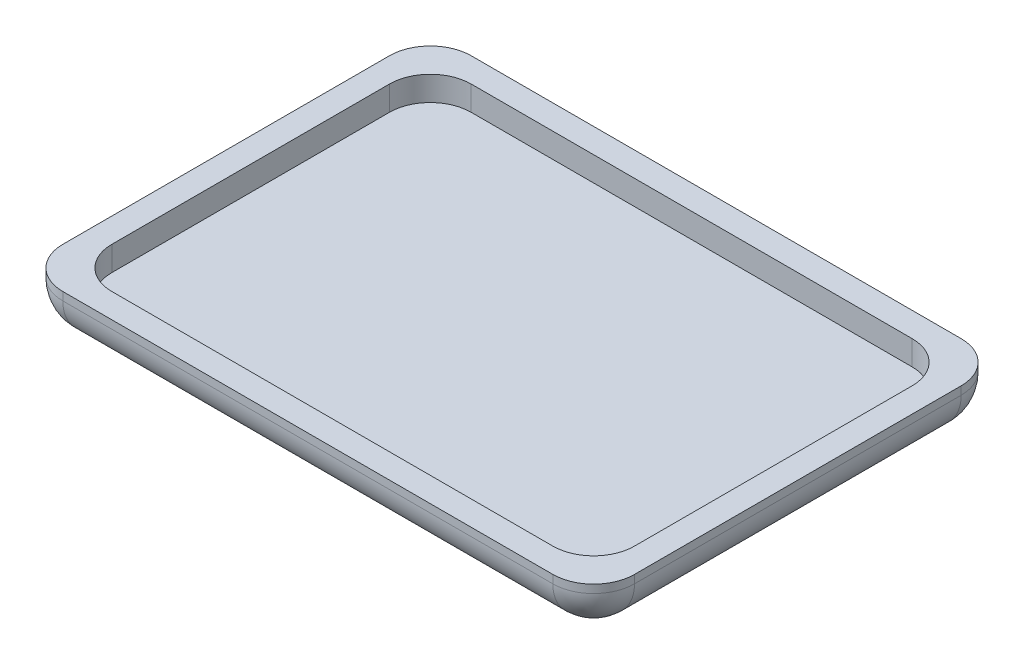
ISO-10303-21;
HEADER;
FILE_DESCRIPTION(('STEP AP214'),'2;1');
FILE_NAME('part.step','',(''),(''),'','','');
FILE_SCHEMA(('AUTOMOTIVE_DESIGN { 1 0 10303 214 1 1 1 1 }'));
ENDSEC;
DATA;
#1=APPLICATION_CONTEXT('core data for automotive mechanical design processes');
#2=APPLICATION_PROTOCOL_DEFINITION('international standard','automotive_design',2000,#1);
#3=PRODUCT_CONTEXT('',#1,'mechanical');
#4=PRODUCT('Part','Part','',(#3));
#5=PRODUCT_RELATED_PRODUCT_CATEGORY('part','',(#4));
#6=PRODUCT_DEFINITION_FORMATION('','',#4);
#7=PRODUCT_DEFINITION_CONTEXT('part definition',#1,'design');
#8=PRODUCT_DEFINITION('design','',#6,#7);
#9=PRODUCT_DEFINITION_SHAPE('','',#8);
#10=(LENGTH_UNIT() NAMED_UNIT(*) SI_UNIT(.MILLI.,.METRE.));
#11=(NAMED_UNIT(*) PLANE_ANGLE_UNIT() SI_UNIT($,.RADIAN.));
#12=(NAMED_UNIT(*) SI_UNIT($,.STERADIAN.) SOLID_ANGLE_UNIT());
#13=UNCERTAINTY_MEASURE_WITH_UNIT(LENGTH_MEASURE(1.E-05),#10,'distance_accuracy_value','');
#14=(GEOMETRIC_REPRESENTATION_CONTEXT(3) GLOBAL_UNCERTAINTY_ASSIGNED_CONTEXT((#13)) GLOBAL_UNIT_ASSIGNED_CONTEXT((#10,
#11,#12)) REPRESENTATION_CONTEXT('',''));
#15=CARTESIAN_POINT('',(0.,0.,0.));
#16=DIRECTION('',(0.,0.,1.));
#17=DIRECTION('',(1.,0.,0.));
#18=AXIS2_PLACEMENT_3D('',#15,#16,#17);
#19=CARTESIAN_POINT('',(27.,5.99999999999999,-17.));
#20=DIRECTION('',(0.,-1.,0.));
#21=DIRECTION('',(0.,0.,-1.));
#22=AXIS2_PLACEMENT_3D('',#19,#20,#21);
#23=CYLINDRICAL_SURFACE('',#22,5.);
#24=DIRECTION('',(0.,1.,0.));
#25=VECTOR('',#24,1.);
#26=CARTESIAN_POINT('',(27.,5.99999999999999,-22.));
#27=LINE('',#26,#25);
#28=CARTESIAN_POINT('',(27.,3.,-22.));
#29=VERTEX_POINT('',#28);
#30=CARTESIAN_POINT('',(27.,5.99999999999999,-22.));
#31=VERTEX_POINT('',#30);
#32=EDGE_CURVE('E285',#29,#31,#27,.T.);
#33=ORIENTED_EDGE('',*,*,#32,.F.);
#34=CARTESIAN_POINT('',(27.,3.,-17.));
#35=DIRECTION('',(0.,1.,0.));
#36=DIRECTION('',(0.,0.,1.));
#37=AXIS2_PLACEMENT_3D('',#34,#35,#36);
#38=CIRCLE('',#37,5.);
#39=CARTESIAN_POINT('',(32.,3.,-17.));
#40=VERTEX_POINT('',#39);
#41=EDGE_CURVE('E40',#40,#29,#38,.T.);
#42=ORIENTED_EDGE('',*,*,#41,.F.);
#43=DIRECTION('',(0.,1.,0.));
#44=VECTOR('',#43,1.);
#45=CARTESIAN_POINT('',(32.,5.99999999999999,-17.));
#46=LINE('',#45,#44);
#47=CARTESIAN_POINT('',(32.,5.99999999999999,-17.));
#48=VERTEX_POINT('',#47);
#49=EDGE_CURVE('E288',#48,#40,#46,.F.);
#50=ORIENTED_EDGE('',*,*,#49,.F.);
#51=CARTESIAN_POINT('',(27.,5.99999999999999,-17.));
#52=DIRECTION('',(0.,1.,0.));
#53=DIRECTION('',(0.,0.,1.));
#54=AXIS2_PLACEMENT_3D('',#51,#52,#53);
#55=CIRCLE('',#54,5.);
#56=EDGE_CURVE('E11',#48,#31,#55,.T.);
#57=ORIENTED_EDGE('',*,*,#56,.T.);
#58=EDGE_LOOP('',(#33,#42,#50,#57));
#59=FACE_BOUND('',#58,.T.);
#60=ADVANCED_FACE('F33',(#59),#23,.F.);
#61=CARTESIAN_POINT('',(-27.,5.99999999999999,-17.));
#62=DIRECTION('',(0.,-1.,0.));
#63=DIRECTION('',(0.,0.,-1.));
#64=AXIS2_PLACEMENT_3D('',#61,#62,#63);
#65=CYLINDRICAL_SURFACE('',#64,5.);
#66=DIRECTION('',(0.,1.,0.));
#67=VECTOR('',#66,1.);
#68=CARTESIAN_POINT('',(-32.,5.99999999999999,-17.));
#69=LINE('',#68,#67);
#70=CARTESIAN_POINT('',(-32.,3.,-17.));
#71=VERTEX_POINT('',#70);
#72=CARTESIAN_POINT('',(-32.,5.99999999999999,-17.));
#73=VERTEX_POINT('',#72);
#74=EDGE_CURVE('E275',#71,#73,#69,.T.);
#75=ORIENTED_EDGE('',*,*,#74,.F.);
#76=CARTESIAN_POINT('',(-27.,3.,-17.));
#77=DIRECTION('',(0.,1.,0.));
#78=DIRECTION('',(0.,0.,1.));
#79=AXIS2_PLACEMENT_3D('',#76,#77,#78);
#80=CIRCLE('',#79,5.);
#81=CARTESIAN_POINT('',(-27.,3.,-22.));
#82=VERTEX_POINT('',#81);
#83=EDGE_CURVE('E281',#82,#71,#80,.T.);
#84=ORIENTED_EDGE('',*,*,#83,.F.);
#85=DIRECTION('',(0.,1.,0.));
#86=VECTOR('',#85,1.);
#87=CARTESIAN_POINT('',(-27.,5.99999999999999,-22.));
#88=LINE('',#87,#86);
#89=CARTESIAN_POINT('',(-27.,5.99999999999999,-22.));
#90=VERTEX_POINT('',#89);
#91=EDGE_CURVE('E278',#90,#82,#88,.F.);
#92=ORIENTED_EDGE('',*,*,#91,.F.);
#93=CARTESIAN_POINT('',(-27.,5.99999999999999,-17.));
#94=DIRECTION('',(0.,1.,0.));
#95=DIRECTION('',(0.,0.,1.));
#96=AXIS2_PLACEMENT_3D('',#93,#94,#95);
#97=CIRCLE('',#96,5.);
#98=EDGE_CURVE('E283',#90,#73,#97,.T.);
#99=ORIENTED_EDGE('',*,*,#98,.T.);
#100=EDGE_LOOP('',(#75,#84,#92,#99));
#101=FACE_BOUND('',#100,.T.);
#102=ADVANCED_FACE('F381',(#101),#65,.F.);
#103=CARTESIAN_POINT('',(-27.,5.99999999999999,17.));
#104=DIRECTION('',(0.,-1.,0.));
#105=DIRECTION('',(0.,0.,-1.));
#106=AXIS2_PLACEMENT_3D('',#103,#104,#105);
#107=CYLINDRICAL_SURFACE('',#106,5.);
#108=DIRECTION('',(0.,1.,0.));
#109=VECTOR('',#108,1.);
#110=CARTESIAN_POINT('',(-27.,5.99999999999999,22.));
#111=LINE('',#110,#109);
#112=CARTESIAN_POINT('',(-27.,3.,22.));
#113=VERTEX_POINT('',#112);
#114=CARTESIAN_POINT('',(-27.,5.99999999999999,22.));
#115=VERTEX_POINT('',#114);
#116=EDGE_CURVE('E265',#113,#115,#111,.T.);
#117=ORIENTED_EDGE('',*,*,#116,.F.);
#118=CARTESIAN_POINT('',(-27.,3.,17.));
#119=DIRECTION('',(0.,1.,0.));
#120=DIRECTION('',(0.,0.,1.));
#121=AXIS2_PLACEMENT_3D('',#118,#119,#120);
#122=CIRCLE('',#121,5.);
#123=CARTESIAN_POINT('',(-32.,3.,17.));
#124=VERTEX_POINT('',#123);
#125=EDGE_CURVE('E271',#124,#113,#122,.T.);
#126=ORIENTED_EDGE('',*,*,#125,.F.);
#127=DIRECTION('',(0.,1.,0.));
#128=VECTOR('',#127,1.);
#129=CARTESIAN_POINT('',(-32.,5.99999999999999,17.));
#130=LINE('',#129,#128);
#131=CARTESIAN_POINT('',(-32.,5.99999999999999,17.));
#132=VERTEX_POINT('',#131);
#133=EDGE_CURVE('E268',#132,#124,#130,.F.);
#134=ORIENTED_EDGE('',*,*,#133,.F.);
#135=CARTESIAN_POINT('',(-27.,5.99999999999999,17.));
#136=DIRECTION('',(0.,1.,0.));
#137=DIRECTION('',(0.,0.,1.));
#138=AXIS2_PLACEMENT_3D('',#135,#136,#137);
#139=CIRCLE('',#138,5.);
#140=EDGE_CURVE('E273',#132,#115,#139,.T.);
#141=ORIENTED_EDGE('',*,*,#140,.T.);
#142=EDGE_LOOP('',(#117,#126,#134,#141));
#143=FACE_BOUND('',#142,.T.);
#144=ADVANCED_FACE('F385',(#143),#107,.F.);
#145=CARTESIAN_POINT('',(27.,5.99999999999999,17.));
#146=DIRECTION('',(0.,1.,0.));
#147=DIRECTION('',(0.,0.,1.));
#148=AXIS2_PLACEMENT_3D('',#145,#146,#147);
#149=CYLINDRICAL_SURFACE('',#148,5.);
#150=DIRECTION('',(0.,-1.,0.));
#151=VECTOR('',#150,1.);
#152=CARTESIAN_POINT('',(27.,5.99999999999999,22.));
#153=LINE('',#152,#151);
#154=CARTESIAN_POINT('',(27.,5.99999999999999,22.));
#155=VERTEX_POINT('',#154);
#156=CARTESIAN_POINT('',(27.,3.,22.));
#157=VERTEX_POINT('',#156);
#158=EDGE_CURVE('E255',#155,#157,#153,.T.);
#159=ORIENTED_EDGE('',*,*,#158,.F.);
#160=CARTESIAN_POINT('',(27.,5.99999999999999,17.));
#161=DIRECTION('',(0.,1.,0.));
#162=DIRECTION('',(0.,0.,1.));
#163=AXIS2_PLACEMENT_3D('',#160,#161,#162);
#164=CIRCLE('',#163,5.);
#165=CARTESIAN_POINT('',(32.,5.99999999999999,17.));
#166=VERTEX_POINT('',#165);
#167=EDGE_CURVE('E263',#155,#166,#164,.T.);
#168=ORIENTED_EDGE('',*,*,#167,.T.);
#169=DIRECTION('',(0.,-1.,0.));
#170=VECTOR('',#169,1.);
#171=CARTESIAN_POINT('',(32.,5.99999999999999,17.));
#172=LINE('',#171,#170);
#173=CARTESIAN_POINT('',(32.,3.,17.));
#174=VERTEX_POINT('',#173);
#175=EDGE_CURVE('E258',#174,#166,#172,.F.);
#176=ORIENTED_EDGE('',*,*,#175,.F.);
#177=CARTESIAN_POINT('',(27.,3.,17.));
#178=DIRECTION('',(0.,1.,0.));
#179=DIRECTION('',(0.,0.,1.));
#180=AXIS2_PLACEMENT_3D('',#177,#178,#179);
#181=CIRCLE('',#180,5.);
#182=EDGE_CURVE('E261',#157,#174,#181,.T.);
#183=ORIENTED_EDGE('',*,*,#182,.F.);
#184=EDGE_LOOP('',(#159,#168,#176,#183));
#185=FACE_BOUND('',#184,.T.);
#186=ADVANCED_FACE('F390',(#185),#149,.F.);
#187=CARTESIAN_POINT('',(30.,5.,-20.));
#188=DIRECTION('',(0.,1.,0.));
#189=DIRECTION('',(0.,0.,1.));
#190=AXIS2_PLACEMENT_3D('',#187,#188,#189);
#191=SPHERICAL_SURFACE('',#190,5.);
#192=CARTESIAN_POINT('',(30.,5.,-20.));
#193=DIRECTION('',(0.,0.,1.));
#194=DIRECTION('',(1.,0.,0.));
#195=AXIS2_PLACEMENT_3D('',#192,#193,#194);
#196=CIRCLE('',#195,5.);
#197=CARTESIAN_POINT('',(30.,0.,-20.));
#198=VERTEX_POINT('',#197);
#199=CARTESIAN_POINT('',(35.,5.,-20.));
#200=VERTEX_POINT('',#199);
#201=EDGE_CURVE('E253',#198,#200,#196,.T.);
#202=ORIENTED_EDGE('',*,*,#201,.F.);
#203=CARTESIAN_POINT('',(30.,5.,-20.));
#204=DIRECTION('',(1.,0.,0.));
#205=DIRECTION('',(0.,0.,-1.));
#206=AXIS2_PLACEMENT_3D('',#203,#204,#205);
#207=CIRCLE('',#206,5.);
#208=CARTESIAN_POINT('',(30.,5.,-25.));
#209=VERTEX_POINT('',#208);
#210=EDGE_CURVE('E251',#198,#209,#207,.T.);
#211=ORIENTED_EDGE('',*,*,#210,.T.);
#212=CARTESIAN_POINT('',(30.,5.,-20.));
#213=DIRECTION('',(0.,1.,0.));
#214=DIRECTION('',(0.,0.,1.));
#215=AXIS2_PLACEMENT_3D('',#212,#213,#214);
#216=CIRCLE('',#215,5.);
#217=EDGE_CURVE('E236',#200,#209,#216,.T.);
#218=ORIENTED_EDGE('',*,*,#217,.F.);
#219=EDGE_LOOP('',(#202,#211,#218));
#220=FACE_BOUND('',#219,.T.);
#221=ADVANCED_FACE('F350',(#220),#191,.T.);
#222=CARTESIAN_POINT('',(0.,5.,-20.));
#223=DIRECTION('',(1.,0.,0.));
#224=DIRECTION('',(0.,0.,-1.));
#225=AXIS2_PLACEMENT_3D('',#222,#223,#224);
#226=CYLINDRICAL_SURFACE('',#225,5.);
#227=ORIENTED_EDGE('',*,*,#210,.F.);
#228=DIRECTION('',(1.,0.,0.));
#229=VECTOR('',#228,1.);
#230=CARTESIAN_POINT('',(0.,0.,-20.));
#231=LINE('',#230,#229);
#232=CARTESIAN_POINT('',(-30.,0.,-20.));
#233=VERTEX_POINT('',#232);
#234=EDGE_CURVE('E206',#233,#198,#231,.T.);
#235=ORIENTED_EDGE('',*,*,#234,.F.);
#236=CARTESIAN_POINT('',(-30.,5.,-20.));
#237=DIRECTION('',(1.,0.,0.));
#238=DIRECTION('',(0.,0.,-1.));
#239=AXIS2_PLACEMENT_3D('',#236,#237,#238);
#240=CIRCLE('',#239,5.);
#241=CARTESIAN_POINT('',(-30.,5.,-25.));
#242=VERTEX_POINT('',#241);
#243=EDGE_CURVE('E249',#233,#242,#240,.T.);
#244=ORIENTED_EDGE('',*,*,#243,.T.);
#245=DIRECTION('',(1.,0.,0.));
#246=VECTOR('',#245,1.);
#247=CARTESIAN_POINT('',(-35.,5.,-25.));
#248=LINE('',#247,#246);
#249=EDGE_CURVE('E233',#209,#242,#248,.F.);
#250=ORIENTED_EDGE('',*,*,#249,.F.);
#251=EDGE_LOOP('',(#227,#235,#244,#250));
#252=FACE_BOUND('',#251,.T.);
#253=ADVANCED_FACE('F346',(#252),#226,.T.);
#254=CARTESIAN_POINT('',(-30.,5.,-20.));
#255=DIRECTION('',(0.,1.,0.));
#256=DIRECTION('',(0.,0.,1.));
#257=AXIS2_PLACEMENT_3D('',#254,#255,#256);
#258=SPHERICAL_SURFACE('',#257,5.);
#259=ORIENTED_EDGE('',*,*,#243,.F.);
#260=CARTESIAN_POINT('',(-30.,5.,-20.));
#261=DIRECTION('',(0.,0.,-1.));
#262=DIRECTION('',(-1.,0.,0.));
#263=AXIS2_PLACEMENT_3D('',#260,#261,#262);
#264=CIRCLE('',#263,5.);
#265=CARTESIAN_POINT('',(-35.,5.,-20.));
#266=VERTEX_POINT('',#265);
#267=EDGE_CURVE('E247',#233,#266,#264,.T.);
#268=ORIENTED_EDGE('',*,*,#267,.T.);
#269=CARTESIAN_POINT('',(-30.,5.,-20.));
#270=DIRECTION('',(0.,-1.,0.));
#271=DIRECTION('',(0.,0.,-1.));
#272=AXIS2_PLACEMENT_3D('',#269,#270,#271);
#273=CIRCLE('',#272,5.);
#274=EDGE_CURVE('E230',#242,#266,#273,.F.);
#275=ORIENTED_EDGE('',*,*,#274,.F.);
#276=EDGE_LOOP('',(#259,#268,#275));
#277=FACE_BOUND('',#276,.T.);
#278=ADVANCED_FACE('F378',(#277),#258,.T.);
#279=CARTESIAN_POINT('',(-30.,5.,0.));
#280=DIRECTION('',(0.,0.,-1.));
#281=DIRECTION('',(-1.,0.,0.));
#282=AXIS2_PLACEMENT_3D('',#279,#280,#281);
#283=CYLINDRICAL_SURFACE('',#282,5.);
#284=ORIENTED_EDGE('',*,*,#267,.F.);
#285=DIRECTION('',(0.,0.,-1.));
#286=VECTOR('',#285,1.);
#287=CARTESIAN_POINT('',(-30.,0.,0.));
#288=LINE('',#287,#286);
#289=CARTESIAN_POINT('',(-30.,0.,20.));
#290=VERTEX_POINT('',#289);
#291=EDGE_CURVE('E209',#290,#233,#288,.T.);
#292=ORIENTED_EDGE('',*,*,#291,.F.);
#293=CARTESIAN_POINT('',(-30.,5.,20.));
#294=DIRECTION('',(0.,0.,-1.));
#295=DIRECTION('',(-1.,0.,0.));
#296=AXIS2_PLACEMENT_3D('',#293,#294,#295);
#297=CIRCLE('',#296,5.);
#298=CARTESIAN_POINT('',(-35.,5.,20.));
#299=VERTEX_POINT('',#298);
#300=EDGE_CURVE('E245',#290,#299,#297,.T.);
#301=ORIENTED_EDGE('',*,*,#300,.T.);
#302=DIRECTION('',(0.,0.,-1.));
#303=VECTOR('',#302,1.);
#304=CARTESIAN_POINT('',(-35.,5.,-25.));
#305=LINE('',#304,#303);
#306=EDGE_CURVE('E227',#266,#299,#305,.F.);
#307=ORIENTED_EDGE('',*,*,#306,.F.);
#308=EDGE_LOOP('',(#284,#292,#301,#307));
#309=FACE_BOUND('',#308,.T.);
#310=ADVANCED_FACE('F369',(#309),#283,.T.);
#311=CARTESIAN_POINT('',(-30.,5.,20.));
#312=DIRECTION('',(0.,1.,0.));
#313=DIRECTION('',(0.,0.,1.));
#314=AXIS2_PLACEMENT_3D('',#311,#312,#313);
#315=SPHERICAL_SURFACE('',#314,5.);
#316=ORIENTED_EDGE('',*,*,#300,.F.);
#317=CARTESIAN_POINT('',(-30.,5.,20.));
#318=DIRECTION('',(-1.,0.,0.));
#319=DIRECTION('',(0.,0.,1.));
#320=AXIS2_PLACEMENT_3D('',#317,#318,#319);
#321=CIRCLE('',#320,5.);
#322=CARTESIAN_POINT('',(-30.,5.,25.));
#323=VERTEX_POINT('',#322);
#324=EDGE_CURVE('E243',#290,#323,#321,.T.);
#325=ORIENTED_EDGE('',*,*,#324,.T.);
#326=CARTESIAN_POINT('',(-30.,5.,20.));
#327=DIRECTION('',(0.,-1.,0.));
#328=DIRECTION('',(0.,0.,-1.));
#329=AXIS2_PLACEMENT_3D('',#326,#327,#328);
#330=CIRCLE('',#329,5.);
#331=EDGE_CURVE('E224',#299,#323,#330,.F.);
#332=ORIENTED_EDGE('',*,*,#331,.F.);
#333=EDGE_LOOP('',(#316,#325,#332));
#334=FACE_BOUND('',#333,.T.);
#335=ADVANCED_FACE('F370',(#334),#315,.T.);
#336=CARTESIAN_POINT('',(0.,5.,20.));
#337=DIRECTION('',(-1.,0.,0.));
#338=DIRECTION('',(0.,0.,1.));
#339=AXIS2_PLACEMENT_3D('',#336,#337,#338);
#340=CYLINDRICAL_SURFACE('',#339,5.);
#341=ORIENTED_EDGE('',*,*,#324,.F.);
#342=DIRECTION('',(-1.,0.,0.));
#343=VECTOR('',#342,1.);
#344=CARTESIAN_POINT('',(0.,0.,20.));
#345=LINE('',#344,#343);
#346=CARTESIAN_POINT('',(30.,0.,20.));
#347=VERTEX_POINT('',#346);
#348=EDGE_CURVE('E212',#347,#290,#345,.T.);
#349=ORIENTED_EDGE('',*,*,#348,.F.);
#350=CARTESIAN_POINT('',(30.,5.,20.));
#351=DIRECTION('',(-1.,0.,0.));
#352=DIRECTION('',(0.,0.,1.));
#353=AXIS2_PLACEMENT_3D('',#350,#351,#352);
#354=CIRCLE('',#353,5.);
#355=CARTESIAN_POINT('',(30.,5.,25.));
#356=VERTEX_POINT('',#355);
#357=EDGE_CURVE('E241',#347,#356,#354,.T.);
#358=ORIENTED_EDGE('',*,*,#357,.T.);
#359=DIRECTION('',(-1.,0.,0.));
#360=VECTOR('',#359,1.);
#361=CARTESIAN_POINT('',(-35.,5.,25.));
#362=LINE('',#361,#360);
#363=EDGE_CURVE('E162',#323,#356,#362,.F.);
#364=ORIENTED_EDGE('',*,*,#363,.F.);
#365=EDGE_LOOP('',(#341,#349,#358,#364));
#366=FACE_BOUND('',#365,.T.);
#367=ADVANCED_FACE('F331',(#366),#340,.T.);
#368=CARTESIAN_POINT('',(30.,5.,20.));
#369=DIRECTION('',(0.,1.,0.));
#370=DIRECTION('',(0.,0.,1.));
#371=AXIS2_PLACEMENT_3D('',#368,#369,#370);
#372=SPHERICAL_SURFACE('',#371,5.);
#373=ORIENTED_EDGE('',*,*,#357,.F.);
#374=CARTESIAN_POINT('',(30.,5.,20.));
#375=DIRECTION('',(0.,0.,1.));
#376=DIRECTION('',(1.,0.,0.));
#377=AXIS2_PLACEMENT_3D('',#374,#375,#376);
#378=CIRCLE('',#377,5.);
#379=CARTESIAN_POINT('',(35.,5.,20.));
#380=VERTEX_POINT('',#379);
#381=EDGE_CURVE('E239',#347,#380,#378,.T.);
#382=ORIENTED_EDGE('',*,*,#381,.T.);
#383=CARTESIAN_POINT('',(30.,5.,20.));
#384=DIRECTION('',(0.,1.,0.));
#385=DIRECTION('',(0.,0.,1.));
#386=AXIS2_PLACEMENT_3D('',#383,#384,#385);
#387=CIRCLE('',#386,5.);
#388=EDGE_CURVE('E221',#356,#380,#387,.T.);
#389=ORIENTED_EDGE('',*,*,#388,.F.);
#390=EDGE_LOOP('',(#373,#382,#389));
#391=FACE_BOUND('',#390,.T.);
#392=ADVANCED_FACE('F335',(#391),#372,.T.);
#393=CARTESIAN_POINT('',(30.,5.,0.));
#394=DIRECTION('',(0.,0.,1.));
#395=DIRECTION('',(1.,0.,0.));
#396=AXIS2_PLACEMENT_3D('',#393,#394,#395);
#397=CYLINDRICAL_SURFACE('',#396,5.);
#398=DIRECTION('',(0.,0.,1.));
#399=VECTOR('',#398,1.);
#400=CARTESIAN_POINT('',(30.,0.,0.));
#401=LINE('',#400,#399);
#402=EDGE_CURVE('E215',#198,#347,#401,.T.);
#403=ORIENTED_EDGE('',*,*,#402,.F.);
#404=ORIENTED_EDGE('',*,*,#201,.T.);
#405=DIRECTION('',(0.,0.,1.));
#406=VECTOR('',#405,1.);
#407=CARTESIAN_POINT('',(35.,5.,-25.));
#408=LINE('',#407,#406);
#409=EDGE_CURVE('E218',#380,#200,#408,.F.);
#410=ORIENTED_EDGE('',*,*,#409,.F.);
#411=ORIENTED_EDGE('',*,*,#381,.F.);
#412=EDGE_LOOP('',(#403,#404,#410,#411));
#413=FACE_BOUND('',#412,.T.);
#414=ADVANCED_FACE('F339',(#413),#397,.T.);
#415=CARTESIAN_POINT('',(-30.,5.99999999999999,-20.));
#416=DIRECTION('',(0.,-1.,0.));
#417=DIRECTION('',(0.,0.,-1.));
#418=AXIS2_PLACEMENT_3D('',#415,#416,#417);
#419=CYLINDRICAL_SURFACE('',#418,5.);
#420=DIRECTION('',(0.,-1.,0.));
#421=VECTOR('',#420,1.);
#422=CARTESIAN_POINT('',(-30.,5.99999999999999,-25.));
#423=LINE('',#422,#421);
#424=CARTESIAN_POINT('',(-30.,5.99999999999999,-25.));
#425=VERTEX_POINT('',#424);
#426=EDGE_CURVE('E202',#242,#425,#423,.F.);
#427=ORIENTED_EDGE('',*,*,#426,.F.);
#428=ORIENTED_EDGE('',*,*,#274,.T.);
#429=DIRECTION('',(0.,-1.,0.));
#430=VECTOR('',#429,1.);
#431=CARTESIAN_POINT('',(-35.,5.99999999999999,-20.));
#432=LINE('',#431,#430);
#433=CARTESIAN_POINT('',(-35.,5.99999999999999,-20.));
#434=VERTEX_POINT('',#433);
#435=EDGE_CURVE('E199',#434,#266,#432,.T.);
#436=ORIENTED_EDGE('',*,*,#435,.F.);
#437=CARTESIAN_POINT('',(-30.,5.99999999999999,-20.));
#438=DIRECTION('',(0.,1.,0.));
#439=DIRECTION('',(0.,0.,1.));
#440=AXIS2_PLACEMENT_3D('',#437,#438,#439);
#441=CIRCLE('',#440,5.);
#442=EDGE_CURVE('E204',#425,#434,#441,.T.);
#443=ORIENTED_EDGE('',*,*,#442,.F.);
#444=EDGE_LOOP('',(#427,#428,#436,#443));
#445=FACE_BOUND('',#444,.T.);
#446=ADVANCED_FACE('F364',(#445),#419,.T.);
#447=CARTESIAN_POINT('',(-30.,5.99999999999999,20.));
#448=DIRECTION('',(0.,-1.,0.));
#449=DIRECTION('',(0.,0.,-1.));
#450=AXIS2_PLACEMENT_3D('',#447,#448,#449);
#451=CYLINDRICAL_SURFACE('',#450,5.);
#452=DIRECTION('',(0.,-1.,0.));
#453=VECTOR('',#452,1.);
#454=CARTESIAN_POINT('',(-35.,5.99999999999999,20.));
#455=LINE('',#454,#453);
#456=CARTESIAN_POINT('',(-35.,5.99999999999999,20.));
#457=VERTEX_POINT('',#456);
#458=EDGE_CURVE('E196',#299,#457,#455,.F.);
#459=ORIENTED_EDGE('',*,*,#458,.F.);
#460=ORIENTED_EDGE('',*,*,#331,.T.);
#461=DIRECTION('',(0.,-1.,0.));
#462=VECTOR('',#461,1.);
#463=CARTESIAN_POINT('',(-30.,5.99999999999999,25.));
#464=LINE('',#463,#462);
#465=CARTESIAN_POINT('',(-30.,5.99999999999999,25.));
#466=VERTEX_POINT('',#465);
#467=EDGE_CURVE('E194',#466,#323,#464,.T.);
#468=ORIENTED_EDGE('',*,*,#467,.F.);
#469=CARTESIAN_POINT('',(-30.,5.99999999999999,20.));
#470=DIRECTION('',(0.,1.,0.));
#471=DIRECTION('',(0.,0.,1.));
#472=AXIS2_PLACEMENT_3D('',#469,#470,#471);
#473=CIRCLE('',#472,5.);
#474=EDGE_CURVE('E177',#457,#466,#473,.T.);
#475=ORIENTED_EDGE('',*,*,#474,.F.);
#476=EDGE_LOOP('',(#459,#460,#468,#475));
#477=FACE_BOUND('',#476,.T.);
#478=ADVANCED_FACE('F326',(#477),#451,.T.);
#479=CARTESIAN_POINT('',(30.,5.99999999999999,-20.));
#480=DIRECTION('',(0.,1.,0.));
#481=DIRECTION('',(0.,0.,1.));
#482=AXIS2_PLACEMENT_3D('',#479,#480,#481);
#483=CYLINDRICAL_SURFACE('',#482,5.);
#484=DIRECTION('',(0.,1.,0.));
#485=VECTOR('',#484,1.);
#486=CARTESIAN_POINT('',(35.,5.99999999999999,-20.));
#487=LINE('',#486,#485);
#488=CARTESIAN_POINT('',(35.,5.99999999999999,-20.));
#489=VERTEX_POINT('',#488);
#490=EDGE_CURVE('E184',#200,#489,#487,.T.);
#491=ORIENTED_EDGE('',*,*,#490,.F.);
#492=ORIENTED_EDGE('',*,*,#217,.T.);
#493=DIRECTION('',(0.,1.,0.));
#494=VECTOR('',#493,1.);
#495=CARTESIAN_POINT('',(30.,5.99999999999999,-25.));
#496=LINE('',#495,#494);
#497=CARTESIAN_POINT('',(30.,5.99999999999999,-25.));
#498=VERTEX_POINT('',#497);
#499=EDGE_CURVE('E186',#498,#209,#496,.F.);
#500=ORIENTED_EDGE('',*,*,#499,.F.);
#501=CARTESIAN_POINT('',(30.,5.99999999999999,-20.));
#502=DIRECTION('',(0.,1.,0.));
#503=DIRECTION('',(0.,0.,1.));
#504=AXIS2_PLACEMENT_3D('',#501,#502,#503);
#505=CIRCLE('',#504,5.);
#506=EDGE_CURVE('E192',#489,#498,#505,.T.);
#507=ORIENTED_EDGE('',*,*,#506,.F.);
#508=EDGE_LOOP('',(#491,#492,#500,#507));
#509=FACE_BOUND('',#508,.T.);
#510=ADVANCED_FACE('F354',(#509),#483,.T.);
#511=CARTESIAN_POINT('',(30.,5.99999999999999,20.));
#512=DIRECTION('',(0.,1.,0.));
#513=DIRECTION('',(0.,0.,1.));
#514=AXIS2_PLACEMENT_3D('',#511,#512,#513);
#515=CYLINDRICAL_SURFACE('',#514,5.);
#516=DIRECTION('',(0.,1.,0.));
#517=VECTOR('',#516,1.);
#518=CARTESIAN_POINT('',(30.,5.99999999999999,25.));
#519=LINE('',#518,#517);
#520=CARTESIAN_POINT('',(30.,5.99999999999999,25.));
#521=VERTEX_POINT('',#520);
#522=EDGE_CURVE('E156',#356,#521,#519,.T.);
#523=ORIENTED_EDGE('',*,*,#522,.F.);
#524=ORIENTED_EDGE('',*,*,#388,.T.);
#525=DIRECTION('',(0.,1.,0.));
#526=VECTOR('',#525,1.);
#527=CARTESIAN_POINT('',(35.,5.99999999999999,20.));
#528=LINE('',#527,#526);
#529=CARTESIAN_POINT('',(35.,5.99999999999999,20.));
#530=VERTEX_POINT('',#529);
#531=EDGE_CURVE('E167',#530,#380,#528,.F.);
#532=ORIENTED_EDGE('',*,*,#531,.F.);
#533=CARTESIAN_POINT('',(30.,5.99999999999999,20.));
#534=DIRECTION('',(0.,1.,0.));
#535=DIRECTION('',(0.,0.,1.));
#536=AXIS2_PLACEMENT_3D('',#533,#534,#535);
#537=CIRCLE('',#536,5.);
#538=EDGE_CURVE('E173',#521,#530,#537,.T.);
#539=ORIENTED_EDGE('',*,*,#538,.F.);
#540=EDGE_LOOP('',(#523,#524,#532,#539));
#541=FACE_BOUND('',#540,.T.);
#542=ADVANCED_FACE('F181',(#541),#515,.T.);
#543=CARTESIAN_POINT('',(35.,5.99999999999999,-25.));
#544=DIRECTION('',(-1.,0.,0.));
#545=DIRECTION('',(0.,0.,1.));
#546=AXIS2_PLACEMENT_3D('',#543,#544,#545);
#547=PLANE('',#546);
#548=ORIENTED_EDGE('',*,*,#531,.T.);
#549=ORIENTED_EDGE('',*,*,#409,.T.);
#550=ORIENTED_EDGE('',*,*,#490,.T.);
#551=DIRECTION('',(0.,0.,-1.));
#552=VECTOR('',#551,1.);
#553=CARTESIAN_POINT('',(35.,5.99999999999999,-25.));
#554=LINE('',#553,#552);
#555=EDGE_CURVE('E316',#530,#489,#554,.T.);
#556=ORIENTED_EDGE('',*,*,#555,.F.);
#557=EDGE_LOOP('',(#548,#549,#550,#556));
#558=FACE_BOUND('',#557,.T.);
#559=ADVANCED_FACE('F358',(#558),#547,.F.);
#560=CARTESIAN_POINT('',(-35.,5.99999999999999,-25.));
#561=DIRECTION('',(0.,0.,1.));
#562=DIRECTION('',(1.,0.,0.));
#563=AXIS2_PLACEMENT_3D('',#560,#561,#562);
#564=PLANE('',#563);
#565=ORIENTED_EDGE('',*,*,#499,.T.);
#566=ORIENTED_EDGE('',*,*,#249,.T.);
#567=ORIENTED_EDGE('',*,*,#426,.T.);
#568=DIRECTION('',(-1.,0.,0.));
#569=VECTOR('',#568,1.);
#570=CARTESIAN_POINT('',(-35.,5.99999999999999,-25.));
#571=LINE('',#570,#569);
#572=EDGE_CURVE('E318',#498,#425,#571,.T.);
#573=ORIENTED_EDGE('',*,*,#572,.F.);
#574=EDGE_LOOP('',(#565,#566,#567,#573));
#575=FACE_BOUND('',#574,.T.);
#576=ADVANCED_FACE('F360',(#575),#564,.F.);
#577=CARTESIAN_POINT('',(-35.,5.99999999999999,-25.));
#578=DIRECTION('',(1.,0.,0.));
#579=DIRECTION('',(0.,0.,-1.));
#580=AXIS2_PLACEMENT_3D('',#577,#578,#579);
#581=PLANE('',#580);
#582=ORIENTED_EDGE('',*,*,#435,.T.);
#583=ORIENTED_EDGE('',*,*,#306,.T.);
#584=ORIENTED_EDGE('',*,*,#458,.T.);
#585=DIRECTION('',(0.,0.,1.));
#586=VECTOR('',#585,1.);
#587=CARTESIAN_POINT('',(-35.,5.99999999999999,-25.));
#588=LINE('',#587,#586);
#589=EDGE_CURVE('E179',#434,#457,#588,.T.);
#590=ORIENTED_EDGE('',*,*,#589,.F.);
#591=EDGE_LOOP('',(#582,#583,#584,#590));
#592=FACE_BOUND('',#591,.T.);
#593=ADVANCED_FACE('F366',(#592),#581,.F.);
#594=CARTESIAN_POINT('',(-35.,5.99999999999999,25.));
#595=DIRECTION('',(0.,0.,-1.));
#596=DIRECTION('',(-1.,0.,0.));
#597=AXIS2_PLACEMENT_3D('',#594,#595,#596);
#598=PLANE('',#597);
#599=ORIENTED_EDGE('',*,*,#467,.T.);
#600=ORIENTED_EDGE('',*,*,#363,.T.);
#601=ORIENTED_EDGE('',*,*,#522,.T.);
#602=DIRECTION('',(1.,0.,0.));
#603=VECTOR('',#602,1.);
#604=CARTESIAN_POINT('',(-35.,5.99999999999999,25.));
#605=LINE('',#604,#603);
#606=EDGE_CURVE('E160',#466,#521,#605,.T.);
#607=ORIENTED_EDGE('',*,*,#606,.F.);
#608=EDGE_LOOP('',(#599,#600,#601,#607));
#609=FACE_BOUND('',#608,.T.);
#610=ADVANCED_FACE('F159',(#609),#598,.F.);
#611=CARTESIAN_POINT('',(0.,5.99999999999999,0.));
#612=DIRECTION('',(0.,1.,0.));
#613=DIRECTION('',(0.,0.,1.));
#614=AXIS2_PLACEMENT_3D('',#611,#612,#613);
#615=PLANE('',#614);
#616=DIRECTION('',(0.,0.,-1.));
#617=VECTOR('',#616,1.);
#618=CARTESIAN_POINT('',(32.,5.99999999999999,-25.));
#619=LINE('',#618,#617);
#620=EDGE_CURVE('E307',#166,#48,#619,.T.);
#621=ORIENTED_EDGE('',*,*,#620,.F.);
#622=ORIENTED_EDGE('',*,*,#167,.F.);
#623=DIRECTION('',(1.,0.,0.));
#624=VECTOR('',#623,1.);
#625=CARTESIAN_POINT('',(-35.,5.99999999999999,22.));
#626=LINE('',#625,#624);
#627=EDGE_CURVE('E314',#115,#155,#626,.T.);
#628=ORIENTED_EDGE('',*,*,#627,.F.);
#629=ORIENTED_EDGE('',*,*,#140,.F.);
#630=DIRECTION('',(0.,0.,1.));
#631=VECTOR('',#630,1.);
#632=CARTESIAN_POINT('',(-32.,5.99999999999999,-25.));
#633=LINE('',#632,#631);
#634=EDGE_CURVE('E312',#73,#132,#633,.T.);
#635=ORIENTED_EDGE('',*,*,#634,.F.);
#636=ORIENTED_EDGE('',*,*,#98,.F.);
#637=DIRECTION('',(-1.,0.,0.));
#638=VECTOR('',#637,1.);
#639=CARTESIAN_POINT('',(-35.,5.99999999999999,-22.));
#640=LINE('',#639,#638);
#641=EDGE_CURVE('E310',#31,#90,#640,.T.);
#642=ORIENTED_EDGE('',*,*,#641,.F.);
#643=ORIENTED_EDGE('',*,*,#56,.F.);
#644=EDGE_LOOP('',(#621,#622,#628,#629,#635,#636,#642,#643));
#645=FACE_BOUND('',#644,.T.);
#646=ORIENTED_EDGE('',*,*,#572,.T.);
#647=ORIENTED_EDGE('',*,*,#442,.T.);
#648=ORIENTED_EDGE('',*,*,#589,.T.);
#649=ORIENTED_EDGE('',*,*,#474,.T.);
#650=ORIENTED_EDGE('',*,*,#606,.T.);
#651=ORIENTED_EDGE('',*,*,#538,.T.);
#652=ORIENTED_EDGE('',*,*,#555,.T.);
#653=ORIENTED_EDGE('',*,*,#506,.T.);
#654=EDGE_LOOP('',(#646,#647,#648,#649,#650,#651,#652,#653));
#655=FACE_BOUND('',#654,.T.);
#656=ADVANCED_FACE('F171',(#645,#655),#615,.T.);
#657=CARTESIAN_POINT('',(0.,0.,0.));
#658=DIRECTION('',(0.,1.,0.));
#659=DIRECTION('',(0.,0.,1.));
#660=AXIS2_PLACEMENT_3D('',#657,#658,#659);
#661=PLANE('',#660);
#662=ORIENTED_EDGE('',*,*,#234,.T.);
#663=ORIENTED_EDGE('',*,*,#402,.T.);
#664=ORIENTED_EDGE('',*,*,#348,.T.);
#665=ORIENTED_EDGE('',*,*,#291,.T.);
#666=EDGE_LOOP('',(#662,#663,#664,#665));
#667=FACE_BOUND('',#666,.T.);
#668=ADVANCED_FACE('F341',(#667),#661,.F.);
#669=CARTESIAN_POINT('',(32.,5.99999999999999,-25.));
#670=DIRECTION('',(-1.,0.,0.));
#671=DIRECTION('',(0.,0.,1.));
#672=AXIS2_PLACEMENT_3D('',#669,#670,#671);
#673=PLANE('',#672);
#674=ORIENTED_EDGE('',*,*,#620,.T.);
#675=ORIENTED_EDGE('',*,*,#49,.T.);
#676=DIRECTION('',(0.,0.,-1.));
#677=VECTOR('',#676,1.);
#678=CARTESIAN_POINT('',(32.,3.,-25.));
#679=LINE('',#678,#677);
#680=EDGE_CURVE('E296',#174,#40,#679,.T.);
#681=ORIENTED_EDGE('',*,*,#680,.F.);
#682=ORIENTED_EDGE('',*,*,#175,.T.);
#683=EDGE_LOOP('',(#674,#675,#681,#682));
#684=FACE_BOUND('',#683,.T.);
#685=ADVANCED_FACE('F516',(#684),#673,.T.);
#686=CARTESIAN_POINT('',(-35.,5.99999999999999,-22.));
#687=DIRECTION('',(0.,0.,1.));
#688=DIRECTION('',(1.,0.,0.));
#689=AXIS2_PLACEMENT_3D('',#686,#687,#688);
#690=PLANE('',#689);
#691=DIRECTION('',(-1.,0.,0.));
#692=VECTOR('',#691,1.);
#693=CARTESIAN_POINT('',(-35.,3.,-22.));
#694=LINE('',#693,#692);
#695=EDGE_CURVE('E293',#29,#82,#694,.T.);
#696=ORIENTED_EDGE('',*,*,#695,.F.);
#697=ORIENTED_EDGE('',*,*,#32,.T.);
#698=ORIENTED_EDGE('',*,*,#641,.T.);
#699=ORIENTED_EDGE('',*,*,#91,.T.);
#700=EDGE_LOOP('',(#696,#697,#698,#699));
#701=FACE_BOUND('',#700,.T.);
#702=ADVANCED_FACE('F298',(#701),#690,.T.);
#703=CARTESIAN_POINT('',(-32.,5.99999999999999,-25.));
#704=DIRECTION('',(1.,0.,0.));
#705=DIRECTION('',(0.,0.,-1.));
#706=AXIS2_PLACEMENT_3D('',#703,#704,#705);
#707=PLANE('',#706);
#708=DIRECTION('',(0.,0.,1.));
#709=VECTOR('',#708,1.);
#710=CARTESIAN_POINT('',(-32.,3.,-25.));
#711=LINE('',#710,#709);
#712=EDGE_CURVE('E300',#71,#124,#711,.T.);
#713=ORIENTED_EDGE('',*,*,#712,.F.);
#714=ORIENTED_EDGE('',*,*,#74,.T.);
#715=ORIENTED_EDGE('',*,*,#634,.T.);
#716=ORIENTED_EDGE('',*,*,#133,.T.);
#717=EDGE_LOOP('',(#713,#714,#715,#716));
#718=FACE_BOUND('',#717,.T.);
#719=ADVANCED_FACE('F539',(#718),#707,.T.);
#720=CARTESIAN_POINT('',(-35.,5.99999999999999,22.));
#721=DIRECTION('',(0.,0.,-1.));
#722=DIRECTION('',(-1.,0.,0.));
#723=AXIS2_PLACEMENT_3D('',#720,#721,#722);
#724=PLANE('',#723);
#725=DIRECTION('',(1.,0.,0.));
#726=VECTOR('',#725,1.);
#727=CARTESIAN_POINT('',(-35.,3.,22.));
#728=LINE('',#727,#726);
#729=EDGE_CURVE('E302',#113,#157,#728,.T.);
#730=ORIENTED_EDGE('',*,*,#729,.F.);
#731=ORIENTED_EDGE('',*,*,#116,.T.);
#732=ORIENTED_EDGE('',*,*,#627,.T.);
#733=ORIENTED_EDGE('',*,*,#158,.T.);
#734=EDGE_LOOP('',(#730,#731,#732,#733));
#735=FACE_BOUND('',#734,.T.);
#736=ADVANCED_FACE('F535',(#735),#724,.T.);
#737=CARTESIAN_POINT('',(0.,3.,0.));
#738=DIRECTION('',(0.,1.,0.));
#739=DIRECTION('',(0.,0.,1.));
#740=AXIS2_PLACEMENT_3D('',#737,#738,#739);
#741=PLANE('',#740);
#742=ORIENTED_EDGE('',*,*,#680,.T.);
#743=ORIENTED_EDGE('',*,*,#41,.T.);
#744=ORIENTED_EDGE('',*,*,#695,.T.);
#745=ORIENTED_EDGE('',*,*,#83,.T.);
#746=ORIENTED_EDGE('',*,*,#712,.T.);
#747=ORIENTED_EDGE('',*,*,#125,.T.);
#748=ORIENTED_EDGE('',*,*,#729,.T.);
#749=ORIENTED_EDGE('',*,*,#182,.T.);
#750=EDGE_LOOP('',(#742,#743,#744,#745,#746,#747,#748,#749));
#751=FACE_BOUND('',#750,.T.);
#752=ADVANCED_FACE('F291',(#751),#741,.T.);
#753=CLOSED_SHELL('',(#60,#102,#144,#186,#221,#253,#278,#310,#335,#367,#392,#414,#446,#478,#510,
#542,#559,#576,#593,#610,#656,#668,#685,#702,#719,#736,#752));
#754=MANIFOLD_SOLID_BREP('B2',#753);
#755=ADVANCED_BREP_SHAPE_REPRESENTATION('',(#18,#754),#14);
#756=SHAPE_DEFINITION_REPRESENTATION(#9,#755);
ENDSEC;
END-ISO-10303-21;
